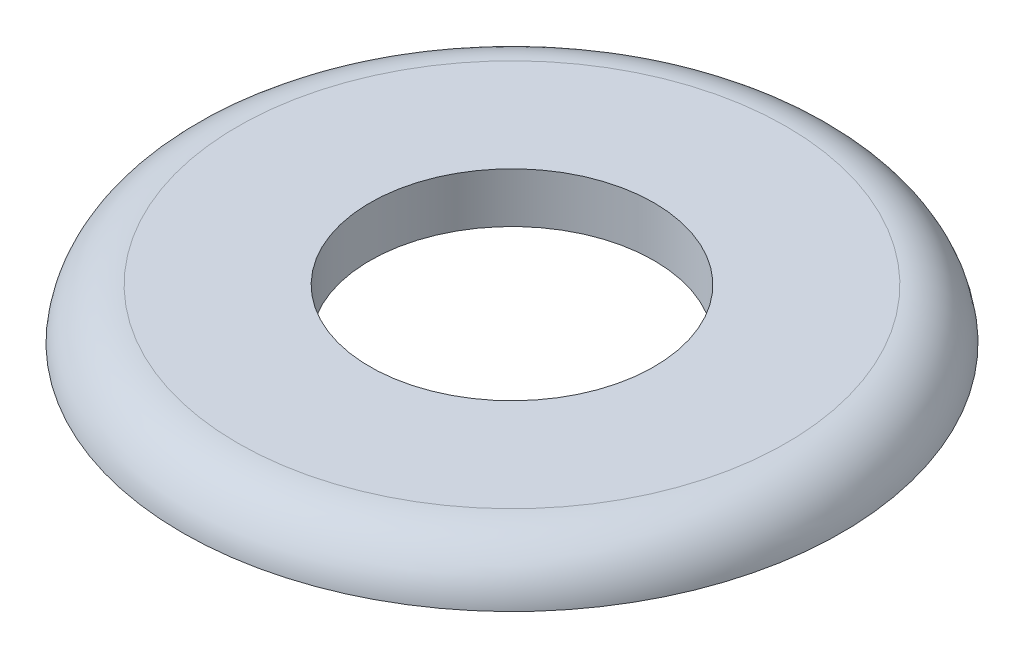
ISO-10303-21;
HEADER;
FILE_DESCRIPTION(('STEP AP214'),'2;1');
FILE_NAME('part.step','',(''),(''),'','','');
FILE_SCHEMA(('AUTOMOTIVE_DESIGN { 1 0 10303 214 1 1 1 1 }'));
ENDSEC;
DATA;
#1=APPLICATION_CONTEXT('core data for automotive mechanical design processes');
#2=APPLICATION_PROTOCOL_DEFINITION('international standard','automotive_design',2000,#1);
#3=PRODUCT_CONTEXT('',#1,'mechanical');
#4=PRODUCT('Part','Part','',(#3));
#5=PRODUCT_RELATED_PRODUCT_CATEGORY('part','',(#4));
#6=PRODUCT_DEFINITION_FORMATION('','',#4);
#7=PRODUCT_DEFINITION_CONTEXT('part definition',#1,'design');
#8=PRODUCT_DEFINITION('design','',#6,#7);
#9=PRODUCT_DEFINITION_SHAPE('','',#8);
#10=(LENGTH_UNIT() NAMED_UNIT(*) SI_UNIT(.MILLI.,.METRE.));
#11=(NAMED_UNIT(*) PLANE_ANGLE_UNIT() SI_UNIT($,.RADIAN.));
#12=(NAMED_UNIT(*) SI_UNIT($,.STERADIAN.) SOLID_ANGLE_UNIT());
#13=UNCERTAINTY_MEASURE_WITH_UNIT(LENGTH_MEASURE(1.E-05),#10,'distance_accuracy_value','');
#14=(GEOMETRIC_REPRESENTATION_CONTEXT(3) GLOBAL_UNCERTAINTY_ASSIGNED_CONTEXT((#13)) GLOBAL_UNIT_ASSIGNED_CONTEXT((#10,
#11,#12)) REPRESENTATION_CONTEXT('',''));
#15=CARTESIAN_POINT('',(0.,0.,0.));
#16=DIRECTION('',(0.,0.,1.));
#17=DIRECTION('',(1.,0.,0.));
#18=AXIS2_PLACEMENT_3D('',#15,#16,#17);
#19=CARTESIAN_POINT('',(0.,5.724525,-3.7703125));
#20=DIRECTION('',(0.,1.,0.));
#21=DIRECTION('',(0.,0.,1.));
#22=AXIS2_PLACEMENT_3D('',#19,#20,#21);
#23=PLANE('',#22);
#24=CARTESIAN_POINT('',(0.,5.724525,0.));
#25=DIRECTION('',(0.,-1.,0.));
#26=DIRECTION('',(0.,0.,-1.));
#27=AXIS2_PLACEMENT_3D('',#24,#25,#26);
#28=CIRCLE('',#27,1.95263971166476);
#29=CARTESIAN_POINT('',(0.,5.724525,-1.95263971166476));
#30=VERTEX_POINT('',#29);
#31=EDGE_CURVE('E44',#30,#30,#28,.T.);
#32=ORIENTED_EDGE('',*,*,#31,.T.);
#33=EDGE_LOOP('',(#32));
#34=FACE_BOUND('',#33,.T.);
#35=CARTESIAN_POINT('',(0.,5.724525,0.));
#36=DIRECTION('',(0.,-1.,0.));
#37=DIRECTION('',(0.,0.,1.));
#38=AXIS2_PLACEMENT_3D('',#35,#36,#37);
#39=CIRCLE('',#38,3.7703125);
#40=CARTESIAN_POINT('',(0.,5.724525,3.7703125));
#41=VERTEX_POINT('',#40);
#42=CARTESIAN_POINT('',(0.,5.724525,-3.7703125));
#43=VERTEX_POINT('',#42);
#44=EDGE_CURVE('E34',#41,#43,#39,.T.);
#45=ORIENTED_EDGE('',*,*,#44,.F.);
#46=CARTESIAN_POINT('',(0.,5.724525,0.));
#47=DIRECTION('',(0.,-1.,0.));
#48=DIRECTION('',(0.,0.,-1.));
#49=AXIS2_PLACEMENT_3D('',#46,#47,#48);
#50=CIRCLE('',#49,3.7703125);
#51=EDGE_CURVE('E38',#43,#41,#50,.T.);
#52=ORIENTED_EDGE('',*,*,#51,.F.);
#53=EDGE_LOOP('',(#45,#52));
#54=FACE_BOUND('',#53,.T.);
#55=ADVANCED_FACE('F17',(#34,#54),#23,.T.);
#56=CARTESIAN_POINT('',(0.,4.9609375,0.));
#57=DIRECTION('',(0.,-1.,0.));
#58=DIRECTION('',(0.,0.,-1.));
#59=AXIS2_PLACEMENT_3D('',#56,#57,#58);
#60=TOROIDAL_SURFACE('',#59,3.7703125,0.7635875);
#61=CARTESIAN_POINT('',(0.,5.0371375,0.));
#62=DIRECTION('',(0.,-1.,0.));
#63=DIRECTION('',(0.,0.,-1.));
#64=AXIS2_PLACEMENT_3D('',#61,#62,#63);
#65=CIRCLE('',#64,4.53008840785458);
#66=CARTESIAN_POINT('',(0.,5.0371375,-4.53008840785458));
#67=VERTEX_POINT('',#66);
#68=EDGE_CURVE('E28',#67,#67,#65,.T.);
#69=ORIENTED_EDGE('',*,*,#68,.F.);
#70=EDGE_LOOP('',(#69));
#71=FACE_BOUND('',#70,.T.);
#72=ORIENTED_EDGE('',*,*,#51,.T.);
#73=ORIENTED_EDGE('',*,*,#44,.T.);
#74=EDGE_LOOP('',(#72,#73));
#75=FACE_BOUND('',#74,.T.);
#76=ADVANCED_FACE('F43',(#71,#75),#60,.T.);
#77=CARTESIAN_POINT('',(0.,5.0371375,0.));
#78=DIRECTION('',(0.,-1.,0.));
#79=DIRECTION('',(0.,0.,-1.));
#80=AXIS2_PLACEMENT_3D('',#77,#78,#79);
#81=CYLINDRICAL_SURFACE('',#80,1.95263971166476);
#82=CARTESIAN_POINT('',(0.,5.0371375,0.));
#83=DIRECTION('',(0.,-1.,0.));
#84=DIRECTION('',(0.,0.,-1.));
#85=AXIS2_PLACEMENT_3D('',#82,#83,#84);
#86=CIRCLE('',#85,1.95263971166476);
#87=CARTESIAN_POINT('',(0.,5.0371375,-1.95263971166476));
#88=VERTEX_POINT('',#87);
#89=EDGE_CURVE('E11',#88,#88,#86,.F.);
#90=ORIENTED_EDGE('',*,*,#89,.F.);
#91=EDGE_LOOP('',(#90));
#92=FACE_BOUND('',#91,.T.);
#93=ORIENTED_EDGE('',*,*,#31,.F.);
#94=EDGE_LOOP('',(#93));
#95=FACE_BOUND('',#94,.T.);
#96=ADVANCED_FACE('F60',(#92,#95),#81,.F.);
#97=CARTESIAN_POINT('',(0.,5.0371375,-1.95263971166476));
#98=DIRECTION('',(0.,-1.,0.));
#99=DIRECTION('',(0.,0.,-1.));
#100=AXIS2_PLACEMENT_3D('',#97,#98,#99);
#101=PLANE('',#100);
#102=ORIENTED_EDGE('',*,*,#89,.T.);
#103=EDGE_LOOP('',(#102));
#104=FACE_BOUND('',#103,.T.);
#105=ORIENTED_EDGE('',*,*,#68,.T.);
#106=EDGE_LOOP('',(#105));
#107=FACE_BOUND('',#106,.T.);
#108=ADVANCED_FACE('F66',(#104,#107),#101,.T.);
#109=CLOSED_SHELL('',(#55,#76,#96,#108));
#110=MANIFOLD_SOLID_BREP('B1',#109);
#111=ADVANCED_BREP_SHAPE_REPRESENTATION('',(#18,#110),#14);
#112=SHAPE_DEFINITION_REPRESENTATION(#9,#111);
ENDSEC;
END-ISO-10303-21;
